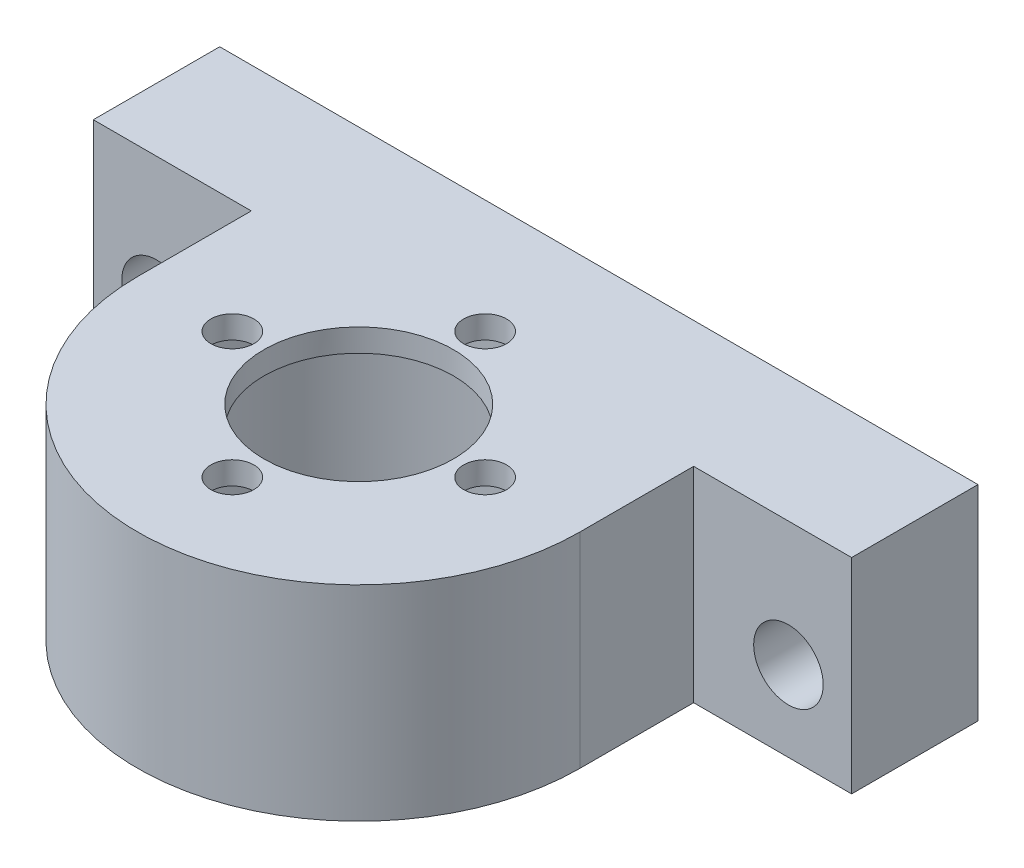
ISO-10303-21;
HEADER;
FILE_DESCRIPTION(('STEP AP214'),'2;1');
FILE_NAME('part.step','',(''),(''),'','','');
FILE_SCHEMA(('AUTOMOTIVE_DESIGN { 1 0 10303 214 1 1 1 1 }'));
ENDSEC;
DATA;
#1=APPLICATION_CONTEXT('core data for automotive mechanical design processes');
#2=APPLICATION_PROTOCOL_DEFINITION('international standard','automotive_design',2000,#1);
#3=PRODUCT_CONTEXT('',#1,'mechanical');
#4=PRODUCT('Part','Part','',(#3));
#5=PRODUCT_RELATED_PRODUCT_CATEGORY('part','',(#4));
#6=PRODUCT_DEFINITION_FORMATION('','',#4);
#7=PRODUCT_DEFINITION_CONTEXT('part definition',#1,'design');
#8=PRODUCT_DEFINITION('design','',#6,#7);
#9=PRODUCT_DEFINITION_SHAPE('','',#8);
#10=(LENGTH_UNIT() NAMED_UNIT(*) SI_UNIT(.MILLI.,.METRE.));
#11=(NAMED_UNIT(*) PLANE_ANGLE_UNIT() SI_UNIT($,.RADIAN.));
#12=(NAMED_UNIT(*) SI_UNIT($,.STERADIAN.) SOLID_ANGLE_UNIT());
#13=UNCERTAINTY_MEASURE_WITH_UNIT(LENGTH_MEASURE(1.E-05),#10,'distance_accuracy_value','');
#14=(GEOMETRIC_REPRESENTATION_CONTEXT(3) GLOBAL_UNCERTAINTY_ASSIGNED_CONTEXT((#13)) GLOBAL_UNIT_ASSIGNED_CONTEXT((#10,
#11,#12)) REPRESENTATION_CONTEXT('',''));
#15=CARTESIAN_POINT('',(0.,0.,0.));
#16=DIRECTION('',(0.,0.,1.));
#17=DIRECTION('',(1.,0.,0.));
#18=AXIS2_PLACEMENT_3D('',#15,#16,#17);
#19=CARTESIAN_POINT('',(0.,12.7,-9.));
#20=DIRECTION('',(0.,0.,1.));
#21=DIRECTION('',(1.,0.,0.));
#22=AXIS2_PLACEMENT_3D('',#19,#20,#21);
#23=PLANE('',#22);
#24=CARTESIAN_POINT('',(-25.,6.35,-9.));
#25=DIRECTION('',(0.,0.,1.));
#26=DIRECTION('',(1.,0.,0.));
#27=AXIS2_PLACEMENT_3D('',#24,#25,#26);
#28=CIRCLE('',#27,2.75);
#29=CARTESIAN_POINT('',(-22.25,6.35,-9.));
#30=VERTEX_POINT('',#29);
#31=EDGE_CURVE('E146',#30,#30,#28,.T.);
#32=ORIENTED_EDGE('',*,*,#31,.F.);
#33=EDGE_LOOP('',(#32));
#34=FACE_BOUND('',#33,.T.);
#35=DIRECTION('',(-1.,0.,0.));
#36=VECTOR('',#35,1.);
#37=CARTESIAN_POINT('',(0.,0.,-9.));
#38=LINE('',#37,#36);
#39=CARTESIAN_POINT('',(-17.5,0.,-9.));
#40=VERTEX_POINT('',#39);
#41=CARTESIAN_POINT('',(-30.,0.,-9.));
#42=VERTEX_POINT('',#41);
#43=EDGE_CURVE('E155',#40,#42,#38,.T.);
#44=ORIENTED_EDGE('',*,*,#43,.F.);
#45=DIRECTION('',(0.,-1.,0.));
#46=VECTOR('',#45,1.);
#47=CARTESIAN_POINT('',(-17.5,12.7,-9.));
#48=LINE('',#47,#46);
#49=CARTESIAN_POINT('',(-17.5,16.2,-9.));
#50=VERTEX_POINT('',#49);
#51=EDGE_CURVE('E11',#50,#40,#48,.T.);
#52=ORIENTED_EDGE('',*,*,#51,.F.);
#53=DIRECTION('',(1.,0.,0.));
#54=VECTOR('',#53,1.);
#55=CARTESIAN_POINT('',(-30.,16.2,-9.));
#56=LINE('',#55,#54);
#57=CARTESIAN_POINT('',(-30.,16.2,-9.));
#58=VERTEX_POINT('',#57);
#59=EDGE_CURVE('E112',#58,#50,#56,.T.);
#60=ORIENTED_EDGE('',*,*,#59,.F.);
#61=DIRECTION('',(0.,-1.,0.));
#62=VECTOR('',#61,1.);
#63=CARTESIAN_POINT('',(-30.,12.7,-9.));
#64=LINE('',#63,#62);
#65=EDGE_CURVE('E56',#58,#42,#64,.T.);
#66=ORIENTED_EDGE('',*,*,#65,.T.);
#67=EDGE_LOOP('',(#44,#52,#60,#66));
#68=FACE_BOUND('',#67,.T.);
#69=ADVANCED_FACE('F40',(#34,#68),#23,.T.);
#70=CARTESIAN_POINT('',(-17.5,12.7,0.));
#71=DIRECTION('',(-1.,0.,0.));
#72=DIRECTION('',(0.,0.,1.));
#73=AXIS2_PLACEMENT_3D('',#70,#71,#72);
#74=PLANE('',#73);
#75=DIRECTION('',(0.,0.,-1.));
#76=VECTOR('',#75,1.);
#77=CARTESIAN_POINT('',(-17.5,0.,0.));
#78=LINE('',#77,#76);
#79=CARTESIAN_POINT('',(-17.5,0.,0.));
#80=VERTEX_POINT('',#79);
#81=EDGE_CURVE('E157',#80,#40,#78,.T.);
#82=ORIENTED_EDGE('',*,*,#81,.F.);
#83=DIRECTION('',(0.,-1.,0.));
#84=VECTOR('',#83,1.);
#85=CARTESIAN_POINT('',(-17.5,12.7,0.));
#86=LINE('',#85,#84);
#87=CARTESIAN_POINT('',(-17.5,16.2,0.));
#88=VERTEX_POINT('',#87);
#89=EDGE_CURVE('E48',#88,#80,#86,.T.);
#90=ORIENTED_EDGE('',*,*,#89,.F.);
#91=DIRECTION('',(0.,0.,1.));
#92=VECTOR('',#91,1.);
#93=CARTESIAN_POINT('',(-17.5,16.2,-9.));
#94=LINE('',#93,#92);
#95=EDGE_CURVE('E116',#50,#88,#94,.T.);
#96=ORIENTED_EDGE('',*,*,#95,.F.);
#97=ORIENTED_EDGE('',*,*,#51,.T.);
#98=EDGE_LOOP('',(#82,#90,#96,#97));
#99=FACE_BOUND('',#98,.T.);
#100=ADVANCED_FACE('F247',(#99),#74,.T.);
#101=CARTESIAN_POINT('',(0.,12.7,0.));
#102=DIRECTION('',(0.,-1.,0.));
#103=DIRECTION('',(0.,0.,-1.));
#104=AXIS2_PLACEMENT_3D('',#101,#102,#103);
#105=CYLINDRICAL_SURFACE('',#104,17.5);
#106=CARTESIAN_POINT('',(0.,0.,0.));
#107=DIRECTION('',(0.,1.,0.));
#108=DIRECTION('',(0.,0.,1.));
#109=AXIS2_PLACEMENT_3D('',#106,#107,#108);
#110=CIRCLE('',#109,17.5);
#111=CARTESIAN_POINT('',(17.5,0.,0.));
#112=VERTEX_POINT('',#111);
#113=EDGE_CURVE('E160',#80,#112,#110,.T.);
#114=ORIENTED_EDGE('',*,*,#113,.T.);
#115=DIRECTION('',(0.,-1.,0.));
#116=VECTOR('',#115,1.);
#117=CARTESIAN_POINT('',(17.5,12.7,0.));
#118=LINE('',#117,#116);
#119=CARTESIAN_POINT('',(17.5,16.2,0.));
#120=VERTEX_POINT('',#119);
#121=EDGE_CURVE('E184',#120,#112,#118,.T.);
#122=ORIENTED_EDGE('',*,*,#121,.F.);
#123=CARTESIAN_POINT('',(0.,16.2,0.));
#124=DIRECTION('',(0.,1.,0.));
#125=DIRECTION('',(0.,0.,1.));
#126=AXIS2_PLACEMENT_3D('',#123,#124,#125);
#127=CIRCLE('',#126,17.5);
#128=EDGE_CURVE('E131',#88,#120,#127,.T.);
#129=ORIENTED_EDGE('',*,*,#128,.F.);
#130=ORIENTED_EDGE('',*,*,#89,.T.);
#131=EDGE_LOOP('',(#114,#122,#129,#130));
#132=FACE_BOUND('',#131,.T.);
#133=ADVANCED_FACE('F252',(#132),#105,.T.);
#134=CARTESIAN_POINT('',(17.5,12.7,0.));
#135=DIRECTION('',(-1.,0.,0.));
#136=DIRECTION('',(0.,0.,1.));
#137=AXIS2_PLACEMENT_3D('',#134,#135,#136);
#138=PLANE('',#137);
#139=DIRECTION('',(0.,0.,-1.));
#140=VECTOR('',#139,1.);
#141=CARTESIAN_POINT('',(17.5,0.,0.));
#142=LINE('',#141,#140);
#143=CARTESIAN_POINT('',(17.5,0.,-9.));
#144=VERTEX_POINT('',#143);
#145=EDGE_CURVE('E162',#112,#144,#142,.T.);
#146=ORIENTED_EDGE('',*,*,#145,.T.);
#147=DIRECTION('',(0.,-1.,0.));
#148=VECTOR('',#147,1.);
#149=CARTESIAN_POINT('',(17.5,12.7,-9.));
#150=LINE('',#149,#148);
#151=CARTESIAN_POINT('',(17.5,16.2,-9.));
#152=VERTEX_POINT('',#151);
#153=EDGE_CURVE('E182',#152,#144,#150,.T.);
#154=ORIENTED_EDGE('',*,*,#153,.F.);
#155=DIRECTION('',(0.,0.,-1.));
#156=VECTOR('',#155,1.);
#157=CARTESIAN_POINT('',(17.5,16.2,0.));
#158=LINE('',#157,#156);
#159=EDGE_CURVE('E134',#120,#152,#158,.T.);
#160=ORIENTED_EDGE('',*,*,#159,.F.);
#161=ORIENTED_EDGE('',*,*,#121,.T.);
#162=EDGE_LOOP('',(#146,#154,#160,#161));
#163=FACE_BOUND('',#162,.T.);
#164=ADVANCED_FACE('F280',(#163),#138,.F.);
#165=CARTESIAN_POINT('',(0.,12.7,-9.));
#166=DIRECTION('',(0.,0.,1.));
#167=DIRECTION('',(1.,0.,0.));
#168=AXIS2_PLACEMENT_3D('',#165,#166,#167);
#169=PLANE('',#168);
#170=CARTESIAN_POINT('',(25.,6.35,-9.));
#171=DIRECTION('',(0.,0.,1.));
#172=DIRECTION('',(1.,0.,0.));
#173=AXIS2_PLACEMENT_3D('',#170,#171,#172);
#174=CIRCLE('',#173,2.75);
#175=CARTESIAN_POINT('',(27.75,6.35,-9.));
#176=VERTEX_POINT('',#175);
#177=EDGE_CURVE('E152',#176,#176,#174,.T.);
#178=ORIENTED_EDGE('',*,*,#177,.F.);
#179=EDGE_LOOP('',(#178));
#180=FACE_BOUND('',#179,.T.);
#181=DIRECTION('',(-1.,0.,0.));
#182=VECTOR('',#181,1.);
#183=CARTESIAN_POINT('',(0.,0.,-9.));
#184=LINE('',#183,#182);
#185=CARTESIAN_POINT('',(30.,0.,-9.));
#186=VERTEX_POINT('',#185);
#187=EDGE_CURVE('E165',#186,#144,#184,.T.);
#188=ORIENTED_EDGE('',*,*,#187,.F.);
#189=DIRECTION('',(0.,-1.,0.));
#190=VECTOR('',#189,1.);
#191=CARTESIAN_POINT('',(30.,12.7,-9.));
#192=LINE('',#191,#190);
#193=CARTESIAN_POINT('',(30.,16.2,-9.));
#194=VERTEX_POINT('',#193);
#195=EDGE_CURVE('E180',#194,#186,#192,.T.);
#196=ORIENTED_EDGE('',*,*,#195,.F.);
#197=DIRECTION('',(1.,0.,0.));
#198=VECTOR('',#197,1.);
#199=CARTESIAN_POINT('',(17.5,16.2,-9.));
#200=LINE('',#199,#198);
#201=EDGE_CURVE('E137',#152,#194,#200,.T.);
#202=ORIENTED_EDGE('',*,*,#201,.F.);
#203=ORIENTED_EDGE('',*,*,#153,.T.);
#204=EDGE_LOOP('',(#188,#196,#202,#203));
#205=FACE_BOUND('',#204,.T.);
#206=ADVANCED_FACE('F283',(#180,#205),#169,.T.);
#207=CARTESIAN_POINT('',(30.,12.7,0.));
#208=DIRECTION('',(-1.,0.,0.));
#209=DIRECTION('',(0.,0.,1.));
#210=AXIS2_PLACEMENT_3D('',#207,#208,#209);
#211=PLANE('',#210);
#212=DIRECTION('',(0.,0.,-1.));
#213=VECTOR('',#212,1.);
#214=CARTESIAN_POINT('',(30.,0.,0.));
#215=LINE('',#214,#213);
#216=CARTESIAN_POINT('',(30.,0.,-19.));
#217=VERTEX_POINT('',#216);
#218=EDGE_CURVE('E168',#186,#217,#215,.T.);
#219=ORIENTED_EDGE('',*,*,#218,.T.);
#220=DIRECTION('',(0.,-1.,0.));
#221=VECTOR('',#220,1.);
#222=CARTESIAN_POINT('',(30.,12.7,-19.));
#223=LINE('',#222,#221);
#224=CARTESIAN_POINT('',(30.,16.2,-19.));
#225=VERTEX_POINT('',#224);
#226=EDGE_CURVE('E178',#225,#217,#223,.T.);
#227=ORIENTED_EDGE('',*,*,#226,.F.);
#228=DIRECTION('',(0.,0.,-1.));
#229=VECTOR('',#228,1.);
#230=CARTESIAN_POINT('',(30.,16.2,-9.));
#231=LINE('',#230,#229);
#232=EDGE_CURVE('E140',#194,#225,#231,.T.);
#233=ORIENTED_EDGE('',*,*,#232,.F.);
#234=ORIENTED_EDGE('',*,*,#195,.T.);
#235=EDGE_LOOP('',(#219,#227,#233,#234));
#236=FACE_BOUND('',#235,.T.);
#237=ADVANCED_FACE('F265',(#236),#211,.F.);
#238=CARTESIAN_POINT('',(0.,12.7,-19.));
#239=DIRECTION('',(0.,0.,-1.));
#240=DIRECTION('',(-1.,0.,0.));
#241=AXIS2_PLACEMENT_3D('',#238,#239,#240);
#242=PLANE('',#241);
#243=CARTESIAN_POINT('',(-25.,6.35,-19.));
#244=DIRECTION('',(0.,0.,-1.));
#245=DIRECTION('',(-1.,0.,0.));
#246=AXIS2_PLACEMENT_3D('',#243,#244,#245);
#247=CIRCLE('',#246,2.75);
#248=CARTESIAN_POINT('',(-27.75,6.35,-19.));
#249=VERTEX_POINT('',#248);
#250=EDGE_CURVE('E143',#249,#249,#247,.T.);
#251=ORIENTED_EDGE('',*,*,#250,.F.);
#252=EDGE_LOOP('',(#251));
#253=FACE_BOUND('',#252,.T.);
#254=CARTESIAN_POINT('',(25.,6.35,-19.));
#255=DIRECTION('',(0.,0.,-1.));
#256=DIRECTION('',(-1.,0.,0.));
#257=AXIS2_PLACEMENT_3D('',#254,#255,#256);
#258=CIRCLE('',#257,2.75);
#259=CARTESIAN_POINT('',(22.25,6.35,-19.));
#260=VERTEX_POINT('',#259);
#261=EDGE_CURVE('E149',#260,#260,#258,.T.);
#262=ORIENTED_EDGE('',*,*,#261,.F.);
#263=EDGE_LOOP('',(#262));
#264=FACE_BOUND('',#263,.T.);
#265=DIRECTION('',(1.,0.,0.));
#266=VECTOR('',#265,1.);
#267=CARTESIAN_POINT('',(0.,0.,-19.));
#268=LINE('',#267,#266);
#269=CARTESIAN_POINT('',(-30.,0.,-19.));
#270=VERTEX_POINT('',#269);
#271=EDGE_CURVE('E171',#270,#217,#268,.T.);
#272=ORIENTED_EDGE('',*,*,#271,.F.);
#273=DIRECTION('',(0.,-1.,0.));
#274=VECTOR('',#273,1.);
#275=CARTESIAN_POINT('',(-30.,12.7,-19.));
#276=LINE('',#275,#274);
#277=CARTESIAN_POINT('',(-30.,16.2,-19.));
#278=VERTEX_POINT('',#277);
#279=EDGE_CURVE('E64',#278,#270,#276,.T.);
#280=ORIENTED_EDGE('',*,*,#279,.F.);
#281=DIRECTION('',(-1.,0.,0.));
#282=VECTOR('',#281,1.);
#283=CARTESIAN_POINT('',(30.,16.2,-19.));
#284=LINE('',#283,#282);
#285=EDGE_CURVE('E122',#225,#278,#284,.T.);
#286=ORIENTED_EDGE('',*,*,#285,.F.);
#287=ORIENTED_EDGE('',*,*,#226,.T.);
#288=EDGE_LOOP('',(#272,#280,#286,#287));
#289=FACE_BOUND('',#288,.T.);
#290=ADVANCED_FACE('F262',(#253,#264,#289),#242,.T.);
#291=CARTESIAN_POINT('',(-30.,12.7,0.));
#292=DIRECTION('',(-1.,0.,0.));
#293=DIRECTION('',(0.,0.,1.));
#294=AXIS2_PLACEMENT_3D('',#291,#292,#293);
#295=PLANE('',#294);
#296=DIRECTION('',(0.,0.,-1.));
#297=VECTOR('',#296,1.);
#298=CARTESIAN_POINT('',(-30.,0.,0.));
#299=LINE('',#298,#297);
#300=EDGE_CURVE('E108',#42,#270,#299,.T.);
#301=ORIENTED_EDGE('',*,*,#300,.F.);
#302=ORIENTED_EDGE('',*,*,#65,.F.);
#303=DIRECTION('',(0.,0.,1.));
#304=VECTOR('',#303,1.);
#305=CARTESIAN_POINT('',(-30.,16.2,-19.));
#306=LINE('',#305,#304);
#307=EDGE_CURVE('E106',#278,#58,#306,.T.);
#308=ORIENTED_EDGE('',*,*,#307,.F.);
#309=ORIENTED_EDGE('',*,*,#279,.T.);
#310=EDGE_LOOP('',(#301,#302,#308,#309));
#311=FACE_BOUND('',#310,.T.);
#312=ADVANCED_FACE('F104',(#311),#295,.T.);
#313=CARTESIAN_POINT('',(0.,12.7,0.));
#314=DIRECTION('',(0.,-1.,0.));
#315=DIRECTION('',(0.,0.,-1.));
#316=AXIS2_PLACEMENT_3D('',#313,#314,#315);
#317=CYLINDRICAL_SURFACE('',#316,13.);
#318=CARTESIAN_POINT('',(0.,0.,0.));
#319=DIRECTION('',(0.,1.,0.));
#320=DIRECTION('',(0.,0.,1.));
#321=AXIS2_PLACEMENT_3D('',#318,#319,#320);
#322=CIRCLE('',#321,13.);
#323=CARTESIAN_POINT('',(0.,0.,13.));
#324=VERTEX_POINT('',#323);
#325=EDGE_CURVE('E109',#324,#324,#322,.T.);
#326=ORIENTED_EDGE('',*,*,#325,.F.);
#327=EDGE_LOOP('',(#326));
#328=FACE_BOUND('',#327,.T.);
#329=CARTESIAN_POINT('',(0.,14.4,0.));
#330=DIRECTION('',(0.,-1.,0.));
#331=DIRECTION('',(0.,0.,-1.));
#332=AXIS2_PLACEMENT_3D('',#329,#330,#331);
#333=CIRCLE('',#332,13.);
#334=CARTESIAN_POINT('',(0.,14.4,-13.));
#335=VERTEX_POINT('',#334);
#336=EDGE_CURVE('E123',#335,#335,#333,.T.);
#337=ORIENTED_EDGE('',*,*,#336,.F.);
#338=EDGE_LOOP('',(#337));
#339=FACE_BOUND('',#338,.T.);
#340=ADVANCED_FACE('F333',(#328,#339),#317,.F.);
#341=CARTESIAN_POINT('',(0.,0.,0.));
#342=DIRECTION('',(0.,1.,0.));
#343=DIRECTION('',(0.,0.,1.));
#344=AXIS2_PLACEMENT_3D('',#341,#342,#343);
#345=PLANE('',#344);
#346=ORIENTED_EDGE('',*,*,#43,.T.);
#347=ORIENTED_EDGE('',*,*,#300,.T.);
#348=ORIENTED_EDGE('',*,*,#271,.T.);
#349=ORIENTED_EDGE('',*,*,#218,.F.);
#350=ORIENTED_EDGE('',*,*,#187,.T.);
#351=ORIENTED_EDGE('',*,*,#145,.F.);
#352=ORIENTED_EDGE('',*,*,#113,.F.);
#353=ORIENTED_EDGE('',*,*,#81,.T.);
#354=EDGE_LOOP('',(#346,#347,#348,#349,#350,#351,#352,#353));
#355=FACE_BOUND('',#354,.T.);
#356=ORIENTED_EDGE('',*,*,#325,.T.);
#357=EDGE_LOOP('',(#356));
#358=FACE_BOUND('',#357,.T.);
#359=ADVANCED_FACE('F271',(#355,#358),#345,.F.);
#360=CARTESIAN_POINT('',(25.,6.35,-19.));
#361=DIRECTION('',(0.,0.,-1.));
#362=DIRECTION('',(-1.,0.,0.));
#363=AXIS2_PLACEMENT_3D('',#360,#361,#362);
#364=CYLINDRICAL_SURFACE('',#363,2.75);
#365=ORIENTED_EDGE('',*,*,#177,.T.);
#366=EDGE_LOOP('',(#365));
#367=FACE_BOUND('',#366,.T.);
#368=ORIENTED_EDGE('',*,*,#261,.T.);
#369=EDGE_LOOP('',(#368));
#370=FACE_BOUND('',#369,.T.);
#371=ADVANCED_FACE('F258',(#367,#370),#364,.F.);
#372=CARTESIAN_POINT('',(-25.,6.35,-19.));
#373=DIRECTION('',(0.,0.,-1.));
#374=DIRECTION('',(-1.,0.,0.));
#375=AXIS2_PLACEMENT_3D('',#372,#373,#374);
#376=CYLINDRICAL_SURFACE('',#375,2.75);
#377=ORIENTED_EDGE('',*,*,#31,.T.);
#378=EDGE_LOOP('',(#377));
#379=FACE_BOUND('',#378,.T.);
#380=ORIENTED_EDGE('',*,*,#250,.T.);
#381=EDGE_LOOP('',(#380));
#382=FACE_BOUND('',#381,.T.);
#383=ADVANCED_FACE('F223',(#379,#382),#376,.F.);
#384=CARTESIAN_POINT('',(0.,16.2,0.));
#385=DIRECTION('',(0.,1.,0.));
#386=DIRECTION('',(0.,0.,1.));
#387=AXIS2_PLACEMENT_3D('',#384,#385,#386);
#388=PLANE('',#387);
#389=CARTESIAN_POINT('',(-9.99999999999972,16.2,2.81155477306172E-13));
#390=DIRECTION('',(0.,1.,0.));
#391=DIRECTION('',(0.,0.,1.));
#392=AXIS2_PLACEMENT_3D('',#389,#390,#391);
#393=CIRCLE('',#392,1.7);
#394=CARTESIAN_POINT('',(-9.99999999999972,16.2,1.70000000000028));
#395=VERTEX_POINT('',#394);
#396=EDGE_CURVE('E214',#395,#395,#393,.T.);
#397=ORIENTED_EDGE('',*,*,#396,.F.);
#398=EDGE_LOOP('',(#397));
#399=FACE_BOUND('',#398,.T.);
#400=CARTESIAN_POINT('',(5.64760248210638E-13,16.2,10.));
#401=DIRECTION('',(0.,1.,0.));
#402=DIRECTION('',(0.,0.,1.));
#403=AXIS2_PLACEMENT_3D('',#400,#401,#402);
#404=CIRCLE('',#403,1.7);
#405=CARTESIAN_POINT('',(5.64760248210638E-13,16.2,11.7));
#406=VERTEX_POINT('',#405);
#407=EDGE_CURVE('E208',#406,#406,#404,.T.);
#408=ORIENTED_EDGE('',*,*,#407,.F.);
#409=EDGE_LOOP('',(#408));
#410=FACE_BOUND('',#409,.T.);
#411=CARTESIAN_POINT('',(10.0000000000003,16.2,-2.82380124105319E-13));
#412=DIRECTION('',(0.,1.,0.));
#413=DIRECTION('',(0.,0.,1.));
#414=AXIS2_PLACEMENT_3D('',#411,#412,#413);
#415=CIRCLE('',#414,1.7);
#416=CARTESIAN_POINT('',(10.0000000000003,16.2,1.69999999999972));
#417=VERTEX_POINT('',#416);
#418=EDGE_CURVE('E202',#417,#417,#415,.T.);
#419=ORIENTED_EDGE('',*,*,#418,.F.);
#420=EDGE_LOOP('',(#419));
#421=FACE_BOUND('',#420,.T.);
#422=CARTESIAN_POINT('',(0.,16.2,-10.));
#423=DIRECTION('',(0.,1.,0.));
#424=DIRECTION('',(0.,0.,1.));
#425=AXIS2_PLACEMENT_3D('',#422,#423,#424);
#426=CIRCLE('',#425,1.7);
#427=CARTESIAN_POINT('',(0.,16.2,-8.3));
#428=VERTEX_POINT('',#427);
#429=EDGE_CURVE('E195',#428,#428,#426,.T.);
#430=ORIENTED_EDGE('',*,*,#429,.F.);
#431=EDGE_LOOP('',(#430));
#432=FACE_BOUND('',#431,.T.);
#433=CARTESIAN_POINT('',(0.,16.2,0.));
#434=DIRECTION('',(0.,1.,0.));
#435=DIRECTION('',(0.,0.,1.));
#436=AXIS2_PLACEMENT_3D('',#433,#434,#435);
#437=CIRCLE('',#436,7.5);
#438=CARTESIAN_POINT('',(0.,16.2,7.5));
#439=VERTEX_POINT('',#438);
#440=EDGE_CURVE('E188',#439,#439,#437,.T.);
#441=ORIENTED_EDGE('',*,*,#440,.F.);
#442=EDGE_LOOP('',(#441));
#443=FACE_BOUND('',#442,.T.);
#444=ORIENTED_EDGE('',*,*,#307,.T.);
#445=ORIENTED_EDGE('',*,*,#59,.T.);
#446=ORIENTED_EDGE('',*,*,#95,.T.);
#447=ORIENTED_EDGE('',*,*,#128,.T.);
#448=ORIENTED_EDGE('',*,*,#159,.T.);
#449=ORIENTED_EDGE('',*,*,#201,.T.);
#450=ORIENTED_EDGE('',*,*,#232,.T.);
#451=ORIENTED_EDGE('',*,*,#285,.T.);
#452=EDGE_LOOP('',(#444,#445,#446,#447,#448,#449,#450,#451));
#453=FACE_BOUND('',#452,.T.);
#454=ADVANCED_FACE('F119',(#399,#410,#421,#432,#443,#453),#388,.T.);
#455=CARTESIAN_POINT('',(0.,14.4,0.));
#456=DIRECTION('',(0.,-1.,0.));
#457=DIRECTION('',(0.,0.,-1.));
#458=AXIS2_PLACEMENT_3D('',#455,#456,#457);
#459=PLANE('',#458);
#460=CARTESIAN_POINT('',(-9.99999999999972,14.4,2.81155477306172E-13));
#461=DIRECTION('',(0.,-1.,0.));
#462=DIRECTION('',(0.,0.,-1.));
#463=AXIS2_PLACEMENT_3D('',#460,#461,#462);
#464=CIRCLE('',#463,1.7);
#465=CARTESIAN_POINT('',(-9.99999999999972,14.4,-1.69999999999972));
#466=VERTEX_POINT('',#465);
#467=EDGE_CURVE('E211',#466,#466,#464,.T.);
#468=ORIENTED_EDGE('',*,*,#467,.F.);
#469=EDGE_LOOP('',(#468));
#470=FACE_BOUND('',#469,.T.);
#471=CARTESIAN_POINT('',(5.64760248210638E-13,14.4,10.));
#472=DIRECTION('',(0.,-1.,0.));
#473=DIRECTION('',(0.,0.,-1.));
#474=AXIS2_PLACEMENT_3D('',#471,#472,#473);
#475=CIRCLE('',#474,1.7);
#476=CARTESIAN_POINT('',(5.64760248210638E-13,14.4,8.3));
#477=VERTEX_POINT('',#476);
#478=EDGE_CURVE('E205',#477,#477,#475,.T.);
#479=ORIENTED_EDGE('',*,*,#478,.F.);
#480=EDGE_LOOP('',(#479));
#481=FACE_BOUND('',#480,.T.);
#482=CARTESIAN_POINT('',(10.0000000000003,14.4,-2.82380124105319E-13));
#483=DIRECTION('',(0.,-1.,0.));
#484=DIRECTION('',(0.,0.,-1.));
#485=AXIS2_PLACEMENT_3D('',#482,#483,#484);
#486=CIRCLE('',#485,1.7);
#487=CARTESIAN_POINT('',(10.0000000000003,14.4,-1.70000000000028));
#488=VERTEX_POINT('',#487);
#489=EDGE_CURVE('E199',#488,#488,#486,.T.);
#490=ORIENTED_EDGE('',*,*,#489,.F.);
#491=EDGE_LOOP('',(#490));
#492=FACE_BOUND('',#491,.T.);
#493=CARTESIAN_POINT('',(0.,14.4,-10.));
#494=DIRECTION('',(0.,-1.,0.));
#495=DIRECTION('',(0.,0.,-1.));
#496=AXIS2_PLACEMENT_3D('',#493,#494,#495);
#497=CIRCLE('',#496,1.7);
#498=CARTESIAN_POINT('',(0.,14.4,-11.7));
#499=VERTEX_POINT('',#498);
#500=EDGE_CURVE('E43',#499,#499,#497,.T.);
#501=ORIENTED_EDGE('',*,*,#500,.F.);
#502=EDGE_LOOP('',(#501));
#503=FACE_BOUND('',#502,.T.);
#504=CARTESIAN_POINT('',(0.,14.4,0.));
#505=DIRECTION('',(0.,-1.,0.));
#506=DIRECTION('',(0.,0.,-1.));
#507=AXIS2_PLACEMENT_3D('',#504,#505,#506);
#508=CIRCLE('',#507,7.5);
#509=CARTESIAN_POINT('',(0.,14.4,-7.5));
#510=VERTEX_POINT('',#509);
#511=EDGE_CURVE('E126',#510,#510,#508,.T.);
#512=ORIENTED_EDGE('',*,*,#511,.F.);
#513=EDGE_LOOP('',(#512));
#514=FACE_BOUND('',#513,.T.);
#515=ORIENTED_EDGE('',*,*,#336,.T.);
#516=EDGE_LOOP('',(#515));
#517=FACE_BOUND('',#516,.T.);
#518=ADVANCED_FACE('F222',(#470,#481,#492,#503,#514,#517),#459,.T.);
#519=CARTESIAN_POINT('',(0.,0.,0.));
#520=DIRECTION('',(0.,1.,0.));
#521=DIRECTION('',(0.,0.,1.));
#522=AXIS2_PLACEMENT_3D('',#519,#520,#521);
#523=CYLINDRICAL_SURFACE('',#522,7.5);
#524=ORIENTED_EDGE('',*,*,#511,.T.);
#525=EDGE_LOOP('',(#524));
#526=FACE_BOUND('',#525,.T.);
#527=ORIENTED_EDGE('',*,*,#440,.T.);
#528=EDGE_LOOP('',(#527));
#529=FACE_BOUND('',#528,.T.);
#530=ADVANCED_FACE('F235',(#526,#529),#523,.F.);
#531=CARTESIAN_POINT('',(0.,16.2,-10.));
#532=DIRECTION('',(0.,1.,0.));
#533=DIRECTION('',(0.,0.,1.));
#534=AXIS2_PLACEMENT_3D('',#531,#532,#533);
#535=CYLINDRICAL_SURFACE('',#534,1.7);
#536=ORIENTED_EDGE('',*,*,#500,.T.);
#537=EDGE_LOOP('',(#536));
#538=FACE_BOUND('',#537,.T.);
#539=ORIENTED_EDGE('',*,*,#429,.T.);
#540=EDGE_LOOP('',(#539));
#541=FACE_BOUND('',#540,.T.);
#542=ADVANCED_FACE('F232',(#538,#541),#535,.F.);
#543=CARTESIAN_POINT('',(10.0000000000003,16.2,-2.82380124105319E-13));
#544=DIRECTION('',(0.,1.,0.));
#545=DIRECTION('',(0.,0.,1.));
#546=AXIS2_PLACEMENT_3D('',#543,#544,#545);
#547=CYLINDRICAL_SURFACE('',#546,1.7);
#548=ORIENTED_EDGE('',*,*,#489,.T.);
#549=EDGE_LOOP('',(#548));
#550=FACE_BOUND('',#549,.T.);
#551=ORIENTED_EDGE('',*,*,#418,.T.);
#552=EDGE_LOOP('',(#551));
#553=FACE_BOUND('',#552,.T.);
#554=ADVANCED_FACE('F234',(#550,#553),#547,.F.);
#555=CARTESIAN_POINT('',(5.64760248210638E-13,16.2,10.));
#556=DIRECTION('',(0.,1.,0.));
#557=DIRECTION('',(0.,0.,1.));
#558=AXIS2_PLACEMENT_3D('',#555,#556,#557);
#559=CYLINDRICAL_SURFACE('',#558,1.7);
#560=ORIENTED_EDGE('',*,*,#478,.T.);
#561=EDGE_LOOP('',(#560));
#562=FACE_BOUND('',#561,.T.);
#563=ORIENTED_EDGE('',*,*,#407,.T.);
#564=EDGE_LOOP('',(#563));
#565=FACE_BOUND('',#564,.T.);
#566=ADVANCED_FACE('F242',(#562,#565),#559,.F.);
#567=CARTESIAN_POINT('',(-9.99999999999972,16.2,2.81155477306172E-13));
#568=DIRECTION('',(0.,1.,0.));
#569=DIRECTION('',(0.,0.,1.));
#570=AXIS2_PLACEMENT_3D('',#567,#568,#569);
#571=CYLINDRICAL_SURFACE('',#570,1.7);
#572=ORIENTED_EDGE('',*,*,#467,.T.);
#573=EDGE_LOOP('',(#572));
#574=FACE_BOUND('',#573,.T.);
#575=ORIENTED_EDGE('',*,*,#396,.T.);
#576=EDGE_LOOP('',(#575));
#577=FACE_BOUND('',#576,.T.);
#578=ADVANCED_FACE('F218',(#574,#577),#571,.F.);
#579=CLOSED_SHELL('',(#69,#100,#133,#164,#206,#237,#290,#312,#340,#359,#371,#383,#454,#518,#530,
#542,#554,#566,#578));
#580=MANIFOLD_SOLID_BREP('B2',#579);
#581=ADVANCED_BREP_SHAPE_REPRESENTATION('',(#18,#580),#14);
#582=SHAPE_DEFINITION_REPRESENTATION(#9,#581);
ENDSEC;
END-ISO-10303-21;
